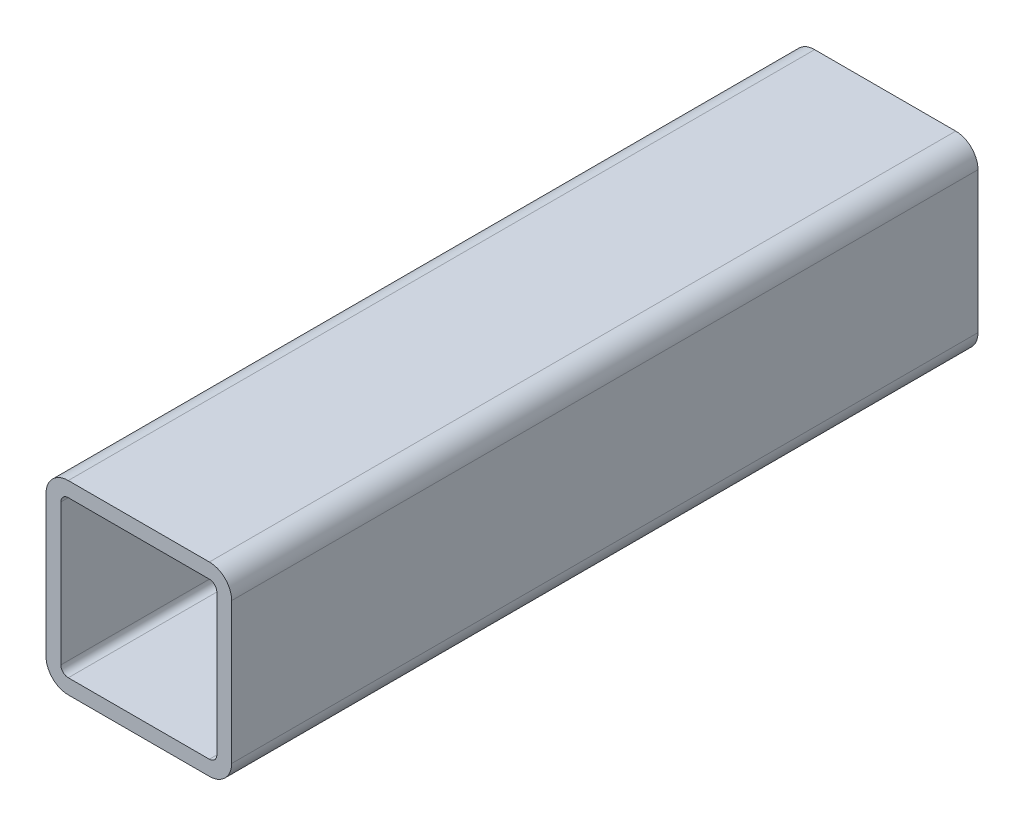
ISO-10303-21;
HEADER;
FILE_DESCRIPTION(('STEP AP214'),'2;1');
FILE_NAME('part.step','',(''),(''),'','','');
FILE_SCHEMA(('AUTOMOTIVE_DESIGN { 1 0 10303 214 1 1 1 1 }'));
ENDSEC;
DATA;
#1=APPLICATION_CONTEXT('core data for automotive mechanical design processes');
#2=APPLICATION_PROTOCOL_DEFINITION('international standard','automotive_design',2000,#1);
#3=PRODUCT_CONTEXT('',#1,'mechanical');
#4=PRODUCT('Part','Part','',(#3));
#5=PRODUCT_RELATED_PRODUCT_CATEGORY('part','',(#4));
#6=PRODUCT_DEFINITION_FORMATION('','',#4);
#7=PRODUCT_DEFINITION_CONTEXT('part definition',#1,'design');
#8=PRODUCT_DEFINITION('design','',#6,#7);
#9=PRODUCT_DEFINITION_SHAPE('','',#8);
#10=(LENGTH_UNIT() NAMED_UNIT(*) SI_UNIT(.MILLI.,.METRE.));
#11=(NAMED_UNIT(*) PLANE_ANGLE_UNIT() SI_UNIT($,.RADIAN.));
#12=(NAMED_UNIT(*) SI_UNIT($,.STERADIAN.) SOLID_ANGLE_UNIT());
#13=UNCERTAINTY_MEASURE_WITH_UNIT(LENGTH_MEASURE(1.E-05),#10,'distance_accuracy_value','');
#14=(GEOMETRIC_REPRESENTATION_CONTEXT(3) GLOBAL_UNCERTAINTY_ASSIGNED_CONTEXT((#13)) GLOBAL_UNIT_ASSIGNED_CONTEXT((#10,
#11,#12)) REPRESENTATION_CONTEXT('',''));
#15=CARTESIAN_POINT('',(0.,0.,0.));
#16=DIRECTION('',(0.,0.,1.));
#17=DIRECTION('',(1.,0.,0.));
#18=AXIS2_PLACEMENT_3D('',#15,#16,#17);
#19=CARTESIAN_POINT('',(5.6932236702778E-12,-7.38964445190504E-12,100.499999999996));
#20=DIRECTION('',(0.,0.,1.));
#21=DIRECTION('',(0.,-1.,0.));
#22=AXIS2_PLACEMENT_3D('',#19,#20,#21);
#23=PLANE('',#22);
#24=DIRECTION('',(0.,1.,0.));
#25=VECTOR('',#24,1.);
#26=CARTESIAN_POINT('',(-12.4999999999943,-4.7500000000074,100.499999999996));
#27=LINE('',#26,#25);
#28=CARTESIAN_POINT('',(-12.4999999999943,-9.50000000000742,100.499999999996));
#29=VERTEX_POINT('',#28);
#30=CARTESIAN_POINT('',(-12.4999999999943,9.49999999999257,100.499999999996));
#31=VERTEX_POINT('',#30);
#32=EDGE_CURVE('E242',#29,#31,#27,.T.);
#33=ORIENTED_EDGE('',*,*,#32,.F.);
#34=CARTESIAN_POINT('',(-9.4999999999943,-9.50000000000742,100.499999999996));
#35=DIRECTION('',(0.,0.,-1.));
#36=DIRECTION('',(1.,0.,0.));
#37=AXIS2_PLACEMENT_3D('',#34,#35,#36);
#38=CIRCLE('',#37,3.);
#39=CARTESIAN_POINT('',(-9.4999999999943,-12.5000000000074,100.499999999996));
#40=VERTEX_POINT('',#39);
#41=EDGE_CURVE('E355',#40,#29,#38,.T.);
#42=ORIENTED_EDGE('',*,*,#41,.F.);
#43=DIRECTION('',(-1.,0.,0.));
#44=VECTOR('',#43,1.);
#45=CARTESIAN_POINT('',(4.7500000000057,-12.5000000000075,100.499999999996));
#46=LINE('',#45,#44);
#47=CARTESIAN_POINT('',(9.50000000000569,-12.5000000000074,100.499999999996));
#48=VERTEX_POINT('',#47);
#49=EDGE_CURVE('E290',#48,#40,#46,.T.);
#50=ORIENTED_EDGE('',*,*,#49,.F.);
#51=CARTESIAN_POINT('',(9.50000000000569,-9.50000000000742,100.499999999996));
#52=DIRECTION('',(0.,0.,-1.));
#53=DIRECTION('',(0.,1.,0.));
#54=AXIS2_PLACEMENT_3D('',#51,#52,#53);
#55=CIRCLE('',#54,3.);
#56=CARTESIAN_POINT('',(12.5000000000057,-9.50000000000749,100.499999999996));
#57=VERTEX_POINT('',#56);
#58=EDGE_CURVE('E213',#57,#48,#55,.T.);
#59=ORIENTED_EDGE('',*,*,#58,.F.);
#60=DIRECTION('',(0.,-1.,0.));
#61=VECTOR('',#60,1.);
#62=CARTESIAN_POINT('',(12.5000000000057,4.74999999999248,100.499999999996));
#63=LINE('',#62,#61);
#64=CARTESIAN_POINT('',(12.5000000000057,9.4999999999925,100.499999999996));
#65=VERTEX_POINT('',#64);
#66=EDGE_CURVE('E224',#65,#57,#63,.T.);
#67=ORIENTED_EDGE('',*,*,#66,.F.);
#68=CARTESIAN_POINT('',(9.50000000000569,9.49999999999264,100.499999999996));
#69=DIRECTION('',(0.,0.,-1.));
#70=DIRECTION('',(-1.,0.,0.));
#71=AXIS2_PLACEMENT_3D('',#68,#69,#70);
#72=CIRCLE('',#71,3.);
#73=CARTESIAN_POINT('',(9.5000000000057,12.4999999999926,100.499999999996));
#74=VERTEX_POINT('',#73);
#75=EDGE_CURVE('E27',#74,#65,#72,.T.);
#76=ORIENTED_EDGE('',*,*,#75,.F.);
#77=DIRECTION('',(1.,0.,0.));
#78=VECTOR('',#77,1.);
#79=CARTESIAN_POINT('',(-4.74999999999431,12.4999999999926,100.499999999996));
#80=LINE('',#79,#78);
#81=CARTESIAN_POINT('',(-9.49999999999431,12.4999999999926,100.499999999996));
#82=VERTEX_POINT('',#81);
#83=EDGE_CURVE('E316',#82,#74,#80,.T.);
#84=ORIENTED_EDGE('',*,*,#83,.F.);
#85=CARTESIAN_POINT('',(-9.49999999999431,9.49999999999264,100.499999999996));
#86=DIRECTION('',(0.,0.,-1.));
#87=DIRECTION('',(0.,-1.,0.));
#88=AXIS2_PLACEMENT_3D('',#85,#86,#87);
#89=CIRCLE('',#88,3.);
#90=EDGE_CURVE('E269',#31,#82,#89,.T.);
#91=ORIENTED_EDGE('',*,*,#90,.F.);
#92=EDGE_LOOP('',(#33,#42,#50,#59,#67,#76,#84,#91));
#93=FACE_BOUND('',#92,.T.);
#94=DIRECTION('',(-1.,0.,0.));
#95=VECTOR('',#94,1.);
#96=CARTESIAN_POINT('',(-4.74999999999431,10.4999999999926,100.499999999996));
#97=LINE('',#96,#95);
#98=CARTESIAN_POINT('',(9.50000000000569,10.4999999999926,100.499999999996));
#99=VERTEX_POINT('',#98);
#100=CARTESIAN_POINT('',(-9.49999999999431,10.4999999999926,100.499999999996));
#101=VERTEX_POINT('',#100);
#102=EDGE_CURVE('E190',#99,#101,#97,.T.);
#103=ORIENTED_EDGE('',*,*,#102,.F.);
#104=CARTESIAN_POINT('',(9.50000000000569,9.49999999999264,100.499999999996));
#105=DIRECTION('',(0.,0.,1.));
#106=DIRECTION('',(-1.,0.,0.));
#107=AXIS2_PLACEMENT_3D('',#104,#105,#106);
#108=CIRCLE('',#107,1.);
#109=CARTESIAN_POINT('',(10.5000000000057,9.49999999999264,100.499999999996));
#110=VERTEX_POINT('',#109);
#111=EDGE_CURVE('E257',#110,#99,#108,.T.);
#112=ORIENTED_EDGE('',*,*,#111,.F.);
#113=DIRECTION('',(0.,1.,0.));
#114=VECTOR('',#113,1.);
#115=CARTESIAN_POINT('',(10.5000000000057,4.74999999999262,100.499999999996));
#116=LINE('',#115,#114);
#117=CARTESIAN_POINT('',(10.5000000000057,-9.50000000000735,100.499999999996));
#118=VERTEX_POINT('',#117);
#119=EDGE_CURVE('E270',#118,#110,#116,.T.);
#120=ORIENTED_EDGE('',*,*,#119,.F.);
#121=CARTESIAN_POINT('',(9.50000000000569,-9.50000000000742,100.499999999996));
#122=DIRECTION('',(0.,0.,1.));
#123=DIRECTION('',(0.,1.,0.));
#124=AXIS2_PLACEMENT_3D('',#121,#122,#123);
#125=CIRCLE('',#124,1.);
#126=CARTESIAN_POINT('',(9.50000000000569,-10.5000000000074,100.499999999996));
#127=VERTEX_POINT('',#126);
#128=EDGE_CURVE('E249',#127,#118,#125,.T.);
#129=ORIENTED_EDGE('',*,*,#128,.F.);
#130=DIRECTION('',(1.,0.,0.));
#131=VECTOR('',#130,1.);
#132=CARTESIAN_POINT('',(4.75000000000569,-10.5000000000074,100.499999999996));
#133=LINE('',#132,#131);
#134=CARTESIAN_POINT('',(-9.4999999999943,-10.5000000000074,100.499999999996));
#135=VERTEX_POINT('',#134);
#136=EDGE_CURVE('E281',#135,#127,#133,.T.);
#137=ORIENTED_EDGE('',*,*,#136,.F.);
#138=CARTESIAN_POINT('',(-9.4999999999943,-9.50000000000742,100.499999999996));
#139=DIRECTION('',(0.,0.,1.));
#140=DIRECTION('',(1.,0.,0.));
#141=AXIS2_PLACEMENT_3D('',#138,#139,#140);
#142=CIRCLE('',#141,1.);
#143=CARTESIAN_POINT('',(-10.4999999999943,-9.50000000000742,100.499999999996));
#144=VERTEX_POINT('',#143);
#145=EDGE_CURVE('E20',#144,#135,#142,.T.);
#146=ORIENTED_EDGE('',*,*,#145,.F.);
#147=DIRECTION('',(0.,-1.,0.));
#148=VECTOR('',#147,1.);
#149=CARTESIAN_POINT('',(-10.4999999999943,-4.7500000000074,100.499999999996));
#150=LINE('',#149,#148);
#151=CARTESIAN_POINT('',(-10.4999999999943,9.49999999999257,100.499999999996));
#152=VERTEX_POINT('',#151);
#153=EDGE_CURVE('E350',#152,#144,#150,.T.);
#154=ORIENTED_EDGE('',*,*,#153,.F.);
#155=CARTESIAN_POINT('',(-9.49999999999431,9.49999999999264,100.499999999996));
#156=DIRECTION('',(0.,0.,1.));
#157=DIRECTION('',(0.,-1.,0.));
#158=AXIS2_PLACEMENT_3D('',#155,#156,#157);
#159=CIRCLE('',#158,1.);
#160=EDGE_CURVE('E243',#101,#152,#159,.T.);
#161=ORIENTED_EDGE('',*,*,#160,.F.);
#162=EDGE_LOOP('',(#103,#112,#120,#129,#137,#146,#154,#161));
#163=FACE_BOUND('',#162,.T.);
#164=ADVANCED_FACE('F16',(#93,#163),#23,.T.);
#165=CARTESIAN_POINT('',(5.6932236702778E-12,-7.38964445190504E-12,-3.5527136788005E-12));
#166=DIRECTION('',(0.,0.,1.));
#167=DIRECTION('',(0.,-1.,0.));
#168=AXIS2_PLACEMENT_3D('',#165,#166,#167);
#169=PLANE('',#168);
#170=DIRECTION('',(0.,1.,0.));
#171=VECTOR('',#170,1.);
#172=CARTESIAN_POINT('',(-12.4999999999943,-4.7500000000074,-3.5527136788005E-12));
#173=LINE('',#172,#171);
#174=CARTESIAN_POINT('',(-12.4999999999943,-9.50000000000742,-3.5527136788005E-12));
#175=VERTEX_POINT('',#174);
#176=CARTESIAN_POINT('',(-12.4999999999943,9.49999999999257,-3.5527136788005E-12));
#177=VERTEX_POINT('',#176);
#178=EDGE_CURVE('E266',#175,#177,#173,.T.);
#179=ORIENTED_EDGE('',*,*,#178,.T.);
#180=CARTESIAN_POINT('',(-9.49999999999431,9.49999999999264,-3.5527136788005E-12));
#181=DIRECTION('',(0.,0.,-1.));
#182=DIRECTION('',(0.,-1.,0.));
#183=AXIS2_PLACEMENT_3D('',#180,#181,#182);
#184=CIRCLE('',#183,3.);
#185=CARTESIAN_POINT('',(-9.49999999999431,12.4999999999926,-3.5527136788005E-12));
#186=VERTEX_POINT('',#185);
#187=EDGE_CURVE('E320',#177,#186,#184,.T.);
#188=ORIENTED_EDGE('',*,*,#187,.T.);
#189=DIRECTION('',(1.,0.,0.));
#190=VECTOR('',#189,1.);
#191=CARTESIAN_POINT('',(-4.74999999999431,12.4999999999926,-3.5527136788005E-12));
#192=LINE('',#191,#190);
#193=CARTESIAN_POINT('',(9.50000000000569,12.4999999999926,-3.5527136788005E-12));
#194=VERTEX_POINT('',#193);
#195=EDGE_CURVE('E204',#186,#194,#192,.T.);
#196=ORIENTED_EDGE('',*,*,#195,.T.);
#197=CARTESIAN_POINT('',(9.50000000000569,9.49999999999264,-3.5527136788005E-12));
#198=DIRECTION('',(0.,0.,-1.));
#199=DIRECTION('',(-1.,0.,0.));
#200=AXIS2_PLACEMENT_3D('',#197,#198,#199);
#201=CIRCLE('',#200,3.);
#202=CARTESIAN_POINT('',(12.5000000000057,9.4999999999925,-3.5527136788005E-12));
#203=VERTEX_POINT('',#202);
#204=EDGE_CURVE('E11',#194,#203,#201,.T.);
#205=ORIENTED_EDGE('',*,*,#204,.T.);
#206=DIRECTION('',(0.,-1.,0.));
#207=VECTOR('',#206,1.);
#208=CARTESIAN_POINT('',(12.5000000000057,4.74999999999248,-3.5527136788005E-12));
#209=LINE('',#208,#207);
#210=CARTESIAN_POINT('',(12.5000000000057,-9.50000000000749,-3.5527136788005E-12));
#211=VERTEX_POINT('',#210);
#212=EDGE_CURVE('E201',#203,#211,#209,.T.);
#213=ORIENTED_EDGE('',*,*,#212,.T.);
#214=CARTESIAN_POINT('',(9.50000000000569,-9.50000000000742,-3.5527136788005E-12));
#215=DIRECTION('',(0.,0.,-1.));
#216=DIRECTION('',(0.,1.,0.));
#217=AXIS2_PLACEMENT_3D('',#214,#215,#216);
#218=CIRCLE('',#217,3.);
#219=CARTESIAN_POINT('',(9.50000000000569,-12.5000000000074,-3.5527136788005E-12));
#220=VERTEX_POINT('',#219);
#221=EDGE_CURVE('E288',#211,#220,#218,.T.);
#222=ORIENTED_EDGE('',*,*,#221,.T.);
#223=DIRECTION('',(-1.,0.,0.));
#224=VECTOR('',#223,1.);
#225=CARTESIAN_POINT('',(4.7500000000057,-12.5000000000075,-3.5527136788005E-12));
#226=LINE('',#225,#224);
#227=CARTESIAN_POINT('',(-9.4999999999943,-12.5000000000074,-3.5527136788005E-12));
#228=VERTEX_POINT('',#227);
#229=EDGE_CURVE('E360',#220,#228,#226,.T.);
#230=ORIENTED_EDGE('',*,*,#229,.T.);
#231=CARTESIAN_POINT('',(-9.4999999999943,-9.50000000000742,-3.5527136788005E-12));
#232=DIRECTION('',(0.,0.,-1.));
#233=DIRECTION('',(1.,0.,0.));
#234=AXIS2_PLACEMENT_3D('',#231,#232,#233);
#235=CIRCLE('',#234,3.);
#236=EDGE_CURVE('E313',#228,#175,#235,.T.);
#237=ORIENTED_EDGE('',*,*,#236,.T.);
#238=EDGE_LOOP('',(#179,#188,#196,#205,#213,#222,#230,#237));
#239=FACE_BOUND('',#238,.T.);
#240=DIRECTION('',(-1.,0.,0.));
#241=VECTOR('',#240,1.);
#242=CARTESIAN_POINT('',(-4.74999999999431,10.4999999999926,-3.5527136788005E-12));
#243=LINE('',#242,#241);
#244=CARTESIAN_POINT('',(9.50000000000569,10.4999999999926,-3.5527136788005E-12));
#245=VERTEX_POINT('',#244);
#246=CARTESIAN_POINT('',(-9.49999999999431,10.4999999999926,-3.5527136788005E-12));
#247=VERTEX_POINT('',#246);
#248=EDGE_CURVE('E179',#245,#247,#243,.T.);
#249=ORIENTED_EDGE('',*,*,#248,.T.);
#250=CARTESIAN_POINT('',(-9.49999999999431,9.49999999999264,-3.5527136788005E-12));
#251=DIRECTION('',(0.,0.,1.));
#252=DIRECTION('',(0.,-1.,0.));
#253=AXIS2_PLACEMENT_3D('',#250,#251,#252);
#254=CIRCLE('',#253,1.);
#255=CARTESIAN_POINT('',(-10.4999999999943,9.49999999999257,-3.5527136788005E-12));
#256=VERTEX_POINT('',#255);
#257=EDGE_CURVE('E238',#247,#256,#254,.T.);
#258=ORIENTED_EDGE('',*,*,#257,.T.);
#259=DIRECTION('',(0.,-1.,0.));
#260=VECTOR('',#259,1.);
#261=CARTESIAN_POINT('',(-10.4999999999943,-4.7500000000074,-3.5527136788005E-12));
#262=LINE('',#261,#260);
#263=CARTESIAN_POINT('',(-10.4999999999943,-9.50000000000742,-3.5527136788005E-12));
#264=VERTEX_POINT('',#263);
#265=EDGE_CURVE('E310',#256,#264,#262,.T.);
#266=ORIENTED_EDGE('',*,*,#265,.T.);
#267=CARTESIAN_POINT('',(-9.4999999999943,-9.50000000000742,-3.5527136788005E-12));
#268=DIRECTION('',(0.,0.,1.));
#269=DIRECTION('',(1.,0.,0.));
#270=AXIS2_PLACEMENT_3D('',#267,#268,#269);
#271=CIRCLE('',#270,1.);
#272=CARTESIAN_POINT('',(-9.4999999999943,-10.5000000000074,-3.5527136788005E-12));
#273=VERTEX_POINT('',#272);
#274=EDGE_CURVE('E351',#264,#273,#271,.T.);
#275=ORIENTED_EDGE('',*,*,#274,.T.);
#276=DIRECTION('',(1.,0.,0.));
#277=VECTOR('',#276,1.);
#278=CARTESIAN_POINT('',(4.75000000000569,-10.5000000000074,-3.5527136788005E-12));
#279=LINE('',#278,#277);
#280=CARTESIAN_POINT('',(9.50000000000569,-10.5000000000074,-3.5527136788005E-12));
#281=VERTEX_POINT('',#280);
#282=EDGE_CURVE('E232',#273,#281,#279,.T.);
#283=ORIENTED_EDGE('',*,*,#282,.T.);
#284=CARTESIAN_POINT('',(9.50000000000569,-9.50000000000742,-3.5527136788005E-12));
#285=DIRECTION('',(0.,0.,1.));
#286=DIRECTION('',(0.,1.,0.));
#287=AXIS2_PLACEMENT_3D('',#284,#285,#286);
#288=CIRCLE('',#287,1.);
#289=CARTESIAN_POINT('',(10.5000000000057,-9.50000000000735,-3.5527136788005E-12));
#290=VERTEX_POINT('',#289);
#291=EDGE_CURVE('E248',#281,#290,#288,.T.);
#292=ORIENTED_EDGE('',*,*,#291,.T.);
#293=DIRECTION('',(0.,1.,0.));
#294=VECTOR('',#293,1.);
#295=CARTESIAN_POINT('',(10.5000000000057,4.74999999999262,-3.5527136788005E-12));
#296=LINE('',#295,#294);
#297=CARTESIAN_POINT('',(10.5000000000057,9.49999999999264,-3.5527136788005E-12));
#298=VERTEX_POINT('',#297);
#299=EDGE_CURVE('E261',#290,#298,#296,.T.);
#300=ORIENTED_EDGE('',*,*,#299,.T.);
#301=CARTESIAN_POINT('',(9.50000000000569,9.49999999999264,-3.5527136788005E-12));
#302=DIRECTION('',(0.,0.,1.));
#303=DIRECTION('',(-1.,0.,0.));
#304=AXIS2_PLACEMENT_3D('',#301,#302,#303);
#305=CIRCLE('',#304,1.);
#306=EDGE_CURVE('E352',#298,#245,#305,.T.);
#307=ORIENTED_EDGE('',*,*,#306,.T.);
#308=EDGE_LOOP('',(#249,#258,#266,#275,#283,#292,#300,#307));
#309=FACE_BOUND('',#308,.T.);
#310=ADVANCED_FACE('F197',(#239,#309),#169,.F.);
#311=CARTESIAN_POINT('',(9.50000000000569,9.49999999999264,-3.5527136788005E-12));
#312=DIRECTION('',(0.,0.,1.));
#313=DIRECTION('',(-1.,0.,0.));
#314=AXIS2_PLACEMENT_3D('',#311,#312,#313);
#315=CYLINDRICAL_SURFACE('',#314,3.);
#316=ORIENTED_EDGE('',*,*,#75,.T.);
#317=DIRECTION('',(0.,0.,1.));
#318=VECTOR('',#317,1.);
#319=CARTESIAN_POINT('',(12.5000000000057,9.4999999999925,-3.5527136788005E-12));
#320=LINE('',#319,#318);
#321=EDGE_CURVE('E207',#203,#65,#320,.T.);
#322=ORIENTED_EDGE('',*,*,#321,.F.);
#323=ORIENTED_EDGE('',*,*,#204,.F.);
#324=DIRECTION('',(0.,0.,1.));
#325=VECTOR('',#324,1.);
#326=CARTESIAN_POINT('',(9.50000000000569,12.4999999999926,-3.5527136788005E-12));
#327=LINE('',#326,#325);
#328=EDGE_CURVE('E252',#194,#74,#327,.T.);
#329=ORIENTED_EDGE('',*,*,#328,.T.);
#330=EDGE_LOOP('',(#316,#322,#323,#329));
#331=FACE_BOUND('',#330,.T.);
#332=ADVANCED_FACE('F208',(#331),#315,.T.);
#333=CARTESIAN_POINT('',(-9.49999999999431,12.4999999999926,-3.5527136788005E-12));
#334=DIRECTION('',(0.,1.,0.));
#335=DIRECTION('',(1.,0.,0.));
#336=AXIS2_PLACEMENT_3D('',#333,#334,#335);
#337=PLANE('',#336);
#338=ORIENTED_EDGE('',*,*,#83,.T.);
#339=ORIENTED_EDGE('',*,*,#328,.F.);
#340=ORIENTED_EDGE('',*,*,#195,.F.);
#341=DIRECTION('',(0.,0.,1.));
#342=VECTOR('',#341,1.);
#343=CARTESIAN_POINT('',(-9.49999999999431,12.4999999999926,-3.5527136788005E-12));
#344=LINE('',#343,#342);
#345=EDGE_CURVE('E321',#186,#82,#344,.T.);
#346=ORIENTED_EDGE('',*,*,#345,.T.);
#347=EDGE_LOOP('',(#338,#339,#340,#346));
#348=FACE_BOUND('',#347,.T.);
#349=ADVANCED_FACE('F399',(#348),#337,.T.);
#350=CARTESIAN_POINT('',(-9.49999999999431,9.49999999999264,-3.5527136788005E-12));
#351=DIRECTION('',(0.,0.,1.));
#352=DIRECTION('',(0.,-1.,0.));
#353=AXIS2_PLACEMENT_3D('',#350,#351,#352);
#354=CYLINDRICAL_SURFACE('',#353,3.);
#355=ORIENTED_EDGE('',*,*,#90,.T.);
#356=ORIENTED_EDGE('',*,*,#345,.F.);
#357=ORIENTED_EDGE('',*,*,#187,.F.);
#358=DIRECTION('',(0.,0.,1.));
#359=VECTOR('',#358,1.);
#360=CARTESIAN_POINT('',(-12.4999999999943,9.49999999999257,-3.5527136788005E-12));
#361=LINE('',#360,#359);
#362=EDGE_CURVE('E265',#177,#31,#361,.T.);
#363=ORIENTED_EDGE('',*,*,#362,.T.);
#364=EDGE_LOOP('',(#355,#356,#357,#363));
#365=FACE_BOUND('',#364,.T.);
#366=ADVANCED_FACE('F397',(#365),#354,.T.);
#367=CARTESIAN_POINT('',(-12.4999999999943,-9.50000000000742,-3.5527136788005E-12));
#368=DIRECTION('',(-1.,0.,0.));
#369=DIRECTION('',(0.,1.,0.));
#370=AXIS2_PLACEMENT_3D('',#367,#368,#369);
#371=PLANE('',#370);
#372=ORIENTED_EDGE('',*,*,#32,.T.);
#373=ORIENTED_EDGE('',*,*,#362,.F.);
#374=ORIENTED_EDGE('',*,*,#178,.F.);
#375=DIRECTION('',(0.,0.,1.));
#376=VECTOR('',#375,1.);
#377=CARTESIAN_POINT('',(-12.4999999999943,-9.50000000000742,-3.5527136788005E-12));
#378=LINE('',#377,#376);
#379=EDGE_CURVE('E359',#175,#29,#378,.T.);
#380=ORIENTED_EDGE('',*,*,#379,.T.);
#381=EDGE_LOOP('',(#372,#373,#374,#380));
#382=FACE_BOUND('',#381,.T.);
#383=CARTESIAN_POINT('',(-12.4999999999943,2.49999999999353,35.4999999999958));
#384=DIRECTION('',(1.,0.,0.));
#385=DIRECTION('',(0.,-1.,0.));
#386=AXIS2_PLACEMENT_3D('',#383,#384,#385);
#387=CIRCLE('',#386,3.8235);
#388=CARTESIAN_POINT('',(-12.4999999999943,-1.32350000000649,35.4999999999958));
#389=VERTEX_POINT('',#388);
#390=EDGE_CURVE('E100',#389,#389,#387,.T.);
#391=ORIENTED_EDGE('',*,*,#390,.T.);
#392=EDGE_LOOP('',(#391));
#393=FACE_BOUND('',#392,.T.);
#394=CARTESIAN_POINT('',(-12.4999999999943,2.4999999999973,83.4999999999975));
#395=DIRECTION('',(1.,0.,0.));
#396=DIRECTION('',(0.,-1.,0.));
#397=AXIS2_PLACEMENT_3D('',#394,#395,#396);
#398=CIRCLE('',#397,3.8235);
#399=CARTESIAN_POINT('',(-12.4999999999943,-1.32350000000272,83.4999999999975));
#400=VERTEX_POINT('',#399);
#401=EDGE_CURVE('E253',#400,#400,#398,.T.);
#402=ORIENTED_EDGE('',*,*,#401,.T.);
#403=EDGE_LOOP('',(#402));
#404=FACE_BOUND('',#403,.T.);
#405=ADVANCED_FACE('F423',(#382,#393,#404),#371,.T.);
#406=CARTESIAN_POINT('',(-9.49999999999431,9.49999999999264,-3.5527136788005E-12));
#407=DIRECTION('',(0.,0.,1.));
#408=DIRECTION('',(0.,-1.,0.));
#409=AXIS2_PLACEMENT_3D('',#406,#407,#408);
#410=CYLINDRICAL_SURFACE('',#409,1.);
#411=ORIENTED_EDGE('',*,*,#160,.T.);
#412=DIRECTION('',(0.,0.,1.));
#413=VECTOR('',#412,1.);
#414=CARTESIAN_POINT('',(-10.4999999999943,9.49999999999257,-3.5527136788005E-12));
#415=LINE('',#414,#413);
#416=EDGE_CURVE('E284',#256,#152,#415,.T.);
#417=ORIENTED_EDGE('',*,*,#416,.F.);
#418=ORIENTED_EDGE('',*,*,#257,.F.);
#419=DIRECTION('',(0.,0.,1.));
#420=VECTOR('',#419,1.);
#421=CARTESIAN_POINT('',(-9.49999999999431,10.4999999999926,-3.5527136788005E-12));
#422=LINE('',#421,#420);
#423=EDGE_CURVE('E277',#247,#101,#422,.T.);
#424=ORIENTED_EDGE('',*,*,#423,.T.);
#425=EDGE_LOOP('',(#411,#417,#418,#424));
#426=FACE_BOUND('',#425,.T.);
#427=ADVANCED_FACE('F435',(#426),#410,.F.);
#428=CARTESIAN_POINT('',(-10.4999999999943,-9.50000000000742,-3.5527136788005E-12));
#429=DIRECTION('',(-1.,0.,0.));
#430=DIRECTION('',(0.,0.,1.));
#431=AXIS2_PLACEMENT_3D('',#428,#429,#430);
#432=PLANE('',#431);
#433=ORIENTED_EDGE('',*,*,#153,.T.);
#434=DIRECTION('',(0.,0.,1.));
#435=VECTOR('',#434,1.);
#436=CARTESIAN_POINT('',(-10.4999999999943,-9.50000000000742,-3.5527136788005E-12));
#437=LINE('',#436,#435);
#438=EDGE_CURVE('E347',#264,#144,#437,.T.);
#439=ORIENTED_EDGE('',*,*,#438,.F.);
#440=ORIENTED_EDGE('',*,*,#265,.F.);
#441=ORIENTED_EDGE('',*,*,#416,.T.);
#442=EDGE_LOOP('',(#433,#439,#440,#441));
#443=FACE_BOUND('',#442,.T.);
#444=CARTESIAN_POINT('',(-10.4999999999943,2.49999999999353,35.4999999999958));
#445=DIRECTION('',(-1.,0.,0.));
#446=DIRECTION('',(0.,-1.,0.));
#447=AXIS2_PLACEMENT_3D('',#444,#445,#446);
#448=CIRCLE('',#447,3.8235);
#449=CARTESIAN_POINT('',(-10.4999999999943,6.32349999999356,35.4999999999958));
#450=VERTEX_POINT('',#449);
#451=EDGE_CURVE('E94',#450,#450,#448,.T.);
#452=ORIENTED_EDGE('',*,*,#451,.T.);
#453=EDGE_LOOP('',(#452));
#454=FACE_BOUND('',#453,.T.);
#455=CARTESIAN_POINT('',(-10.4999999999943,2.4999999999973,83.4999999999975));
#456=DIRECTION('',(-1.,0.,0.));
#457=DIRECTION('',(0.,-1.,0.));
#458=AXIS2_PLACEMENT_3D('',#455,#456,#457);
#459=CIRCLE('',#458,3.8235);
#460=CARTESIAN_POINT('',(-10.4999999999943,6.32349999999732,83.4999999999975));
#461=VERTEX_POINT('',#460);
#462=EDGE_CURVE('E256',#461,#461,#459,.T.);
#463=ORIENTED_EDGE('',*,*,#462,.T.);
#464=EDGE_LOOP('',(#463));
#465=FACE_BOUND('',#464,.T.);
#466=ADVANCED_FACE('F432',(#443,#454,#465),#432,.F.);
#467=CARTESIAN_POINT('',(-9.4999999999943,-9.50000000000742,-3.5527136788005E-12));
#468=DIRECTION('',(0.,0.,1.));
#469=DIRECTION('',(1.,0.,0.));
#470=AXIS2_PLACEMENT_3D('',#467,#468,#469);
#471=CYLINDRICAL_SURFACE('',#470,1.);
#472=ORIENTED_EDGE('',*,*,#145,.T.);
#473=DIRECTION('',(0.,0.,1.));
#474=VECTOR('',#473,1.);
#475=CARTESIAN_POINT('',(-9.4999999999943,-10.5000000000074,-3.5527136788005E-12));
#476=LINE('',#475,#474);
#477=EDGE_CURVE('E236',#273,#135,#476,.T.);
#478=ORIENTED_EDGE('',*,*,#477,.F.);
#479=ORIENTED_EDGE('',*,*,#274,.F.);
#480=ORIENTED_EDGE('',*,*,#438,.T.);
#481=EDGE_LOOP('',(#472,#478,#479,#480));
#482=FACE_BOUND('',#481,.T.);
#483=ADVANCED_FACE('F434',(#482),#471,.F.);
#484=CARTESIAN_POINT('',(-9.49999999999431,10.4999999999926,-3.5527136788005E-12));
#485=DIRECTION('',(0.,1.,0.));
#486=DIRECTION('',(1.,0.,0.));
#487=AXIS2_PLACEMENT_3D('',#484,#485,#486);
#488=PLANE('',#487);
#489=ORIENTED_EDGE('',*,*,#102,.T.);
#490=ORIENTED_EDGE('',*,*,#423,.F.);
#491=ORIENTED_EDGE('',*,*,#248,.F.);
#492=DIRECTION('',(0.,0.,1.));
#493=VECTOR('',#492,1.);
#494=CARTESIAN_POINT('',(9.50000000000569,10.4999999999926,-3.5527136788005E-12));
#495=LINE('',#494,#493);
#496=EDGE_CURVE('E228',#245,#99,#495,.T.);
#497=ORIENTED_EDGE('',*,*,#496,.T.);
#498=EDGE_LOOP('',(#489,#490,#491,#497));
#499=FACE_BOUND('',#498,.T.);
#500=ADVANCED_FACE('F440',(#499),#488,.F.);
#501=CARTESIAN_POINT('',(-9.4999999999943,-9.50000000000742,-3.5527136788005E-12));
#502=DIRECTION('',(0.,0.,1.));
#503=DIRECTION('',(1.,0.,0.));
#504=AXIS2_PLACEMENT_3D('',#501,#502,#503);
#505=CYLINDRICAL_SURFACE('',#504,3.);
#506=ORIENTED_EDGE('',*,*,#41,.T.);
#507=ORIENTED_EDGE('',*,*,#379,.F.);
#508=ORIENTED_EDGE('',*,*,#236,.F.);
#509=DIRECTION('',(0.,0.,1.));
#510=VECTOR('',#509,1.);
#511=CARTESIAN_POINT('',(-9.4999999999943,-12.5000000000074,-3.5527136788005E-12));
#512=LINE('',#511,#510);
#513=EDGE_CURVE('E298',#228,#40,#512,.T.);
#514=ORIENTED_EDGE('',*,*,#513,.T.);
#515=EDGE_LOOP('',(#506,#507,#508,#514));
#516=FACE_BOUND('',#515,.T.);
#517=ADVANCED_FACE('F18',(#516),#505,.T.);
#518=CARTESIAN_POINT('',(9.50000000000569,-12.5000000000074,-3.5527136788005E-12));
#519=DIRECTION('',(0.,-1.,0.));
#520=DIRECTION('',(0.,0.,-1.));
#521=AXIS2_PLACEMENT_3D('',#518,#519,#520);
#522=PLANE('',#521);
#523=ORIENTED_EDGE('',*,*,#49,.T.);
#524=ORIENTED_EDGE('',*,*,#513,.F.);
#525=ORIENTED_EDGE('',*,*,#229,.F.);
#526=DIRECTION('',(0.,0.,1.));
#527=VECTOR('',#526,1.);
#528=CARTESIAN_POINT('',(9.50000000000569,-12.5000000000074,-3.5527136788005E-12));
#529=LINE('',#528,#527);
#530=EDGE_CURVE('E287',#220,#48,#529,.T.);
#531=ORIENTED_EDGE('',*,*,#530,.T.);
#532=EDGE_LOOP('',(#523,#524,#525,#531));
#533=FACE_BOUND('',#532,.T.);
#534=ADVANCED_FACE('F404',(#533),#522,.T.);
#535=CARTESIAN_POINT('',(9.50000000000569,-9.50000000000742,-3.5527136788005E-12));
#536=DIRECTION('',(0.,0.,1.));
#537=DIRECTION('',(0.,1.,0.));
#538=AXIS2_PLACEMENT_3D('',#535,#536,#537);
#539=CYLINDRICAL_SURFACE('',#538,3.);
#540=ORIENTED_EDGE('',*,*,#58,.T.);
#541=ORIENTED_EDGE('',*,*,#530,.F.);
#542=ORIENTED_EDGE('',*,*,#221,.F.);
#543=DIRECTION('',(0.,0.,1.));
#544=VECTOR('',#543,1.);
#545=CARTESIAN_POINT('',(12.5000000000057,-9.50000000000749,-3.5527136788005E-12));
#546=LINE('',#545,#544);
#547=EDGE_CURVE('E217',#211,#57,#546,.T.);
#548=ORIENTED_EDGE('',*,*,#547,.T.);
#549=EDGE_LOOP('',(#540,#541,#542,#548));
#550=FACE_BOUND('',#549,.T.);
#551=ADVANCED_FACE('F402',(#550),#539,.T.);
#552=CARTESIAN_POINT('',(12.5000000000057,9.4999999999925,-3.5527136788005E-12));
#553=DIRECTION('',(1.,0.,0.));
#554=DIRECTION('',(0.,1.,0.));
#555=AXIS2_PLACEMENT_3D('',#552,#553,#554);
#556=PLANE('',#555);
#557=ORIENTED_EDGE('',*,*,#66,.T.);
#558=ORIENTED_EDGE('',*,*,#547,.F.);
#559=ORIENTED_EDGE('',*,*,#212,.F.);
#560=ORIENTED_EDGE('',*,*,#321,.T.);
#561=EDGE_LOOP('',(#557,#558,#559,#560));
#562=FACE_BOUND('',#561,.T.);
#563=ADVANCED_FACE('F215',(#562),#556,.T.);
#564=CARTESIAN_POINT('',(9.50000000000569,9.49999999999264,-3.5527136788005E-12));
#565=DIRECTION('',(0.,0.,1.));
#566=DIRECTION('',(-1.,0.,0.));
#567=AXIS2_PLACEMENT_3D('',#564,#565,#566);
#568=CYLINDRICAL_SURFACE('',#567,1.);
#569=ORIENTED_EDGE('',*,*,#111,.T.);
#570=ORIENTED_EDGE('',*,*,#496,.F.);
#571=ORIENTED_EDGE('',*,*,#306,.F.);
#572=DIRECTION('',(0.,0.,1.));
#573=VECTOR('',#572,1.);
#574=CARTESIAN_POINT('',(10.5000000000057,9.49999999999264,-3.5527136788005E-12));
#575=LINE('',#574,#573);
#576=EDGE_CURVE('E273',#298,#110,#575,.T.);
#577=ORIENTED_EDGE('',*,*,#576,.T.);
#578=EDGE_LOOP('',(#569,#570,#571,#577));
#579=FACE_BOUND('',#578,.T.);
#580=ADVANCED_FACE('F411',(#579),#568,.F.);
#581=CARTESIAN_POINT('',(10.5000000000057,9.49999999999264,-3.5527136788005E-12));
#582=DIRECTION('',(1.,0.,0.));
#583=DIRECTION('',(0.,-1.,0.));
#584=AXIS2_PLACEMENT_3D('',#581,#582,#583);
#585=PLANE('',#584);
#586=ORIENTED_EDGE('',*,*,#119,.T.);
#587=ORIENTED_EDGE('',*,*,#576,.F.);
#588=ORIENTED_EDGE('',*,*,#299,.F.);
#589=DIRECTION('',(0.,0.,1.));
#590=VECTOR('',#589,1.);
#591=CARTESIAN_POINT('',(10.5000000000057,-9.50000000000735,-3.5527136788005E-12));
#592=LINE('',#591,#590);
#593=EDGE_CURVE('E244',#290,#118,#592,.T.);
#594=ORIENTED_EDGE('',*,*,#593,.T.);
#595=EDGE_LOOP('',(#586,#587,#588,#594));
#596=FACE_BOUND('',#595,.T.);
#597=ADVANCED_FACE('F627',(#596),#585,.F.);
#598=CARTESIAN_POINT('',(9.50000000000569,-9.50000000000742,-3.5527136788005E-12));
#599=DIRECTION('',(0.,0.,1.));
#600=DIRECTION('',(0.,1.,0.));
#601=AXIS2_PLACEMENT_3D('',#598,#599,#600);
#602=CYLINDRICAL_SURFACE('',#601,1.);
#603=ORIENTED_EDGE('',*,*,#128,.T.);
#604=ORIENTED_EDGE('',*,*,#593,.F.);
#605=ORIENTED_EDGE('',*,*,#291,.F.);
#606=DIRECTION('',(0.,0.,1.));
#607=VECTOR('',#606,1.);
#608=CARTESIAN_POINT('',(9.50000000000569,-10.5000000000074,-3.5527136788005E-12));
#609=LINE('',#608,#607);
#610=EDGE_CURVE('E237',#281,#127,#609,.T.);
#611=ORIENTED_EDGE('',*,*,#610,.T.);
#612=EDGE_LOOP('',(#603,#604,#605,#611));
#613=FACE_BOUND('',#612,.T.);
#614=ADVANCED_FACE('F623',(#613),#602,.F.);
#615=CARTESIAN_POINT('',(9.50000000000569,-10.5000000000074,-3.5527136788005E-12));
#616=DIRECTION('',(0.,-1.,0.));
#617=DIRECTION('',(0.,0.,-1.));
#618=AXIS2_PLACEMENT_3D('',#615,#616,#617);
#619=PLANE('',#618);
#620=ORIENTED_EDGE('',*,*,#136,.T.);
#621=ORIENTED_EDGE('',*,*,#610,.F.);
#622=ORIENTED_EDGE('',*,*,#282,.F.);
#623=ORIENTED_EDGE('',*,*,#477,.T.);
#624=EDGE_LOOP('',(#620,#621,#622,#623));
#625=FACE_BOUND('',#624,.T.);
#626=ADVANCED_FACE('F429',(#625),#619,.F.);
#627=CARTESIAN_POINT('',(-8.49999999999431,2.49999999999353,35.4999999999958));
#628=DIRECTION('',(-1.,0.,0.));
#629=DIRECTION('',(0.,-1.,0.));
#630=AXIS2_PLACEMENT_3D('',#627,#628,#629);
#631=CYLINDRICAL_SURFACE('',#630,3.8235);
#632=ORIENTED_EDGE('',*,*,#390,.F.);
#633=EDGE_LOOP('',(#632));
#634=FACE_BOUND('',#633,.T.);
#635=ORIENTED_EDGE('',*,*,#451,.F.);
#636=EDGE_LOOP('',(#635));
#637=FACE_BOUND('',#636,.T.);
#638=ADVANCED_FACE('F425',(#634,#637),#631,.F.);
#639=CARTESIAN_POINT('',(-8.49999999999431,2.4999999999973,83.4999999999975));
#640=DIRECTION('',(-1.,0.,0.));
#641=DIRECTION('',(0.,-1.,0.));
#642=AXIS2_PLACEMENT_3D('',#639,#640,#641);
#643=CYLINDRICAL_SURFACE('',#642,3.8235);
#644=ORIENTED_EDGE('',*,*,#401,.F.);
#645=EDGE_LOOP('',(#644));
#646=FACE_BOUND('',#645,.T.);
#647=ORIENTED_EDGE('',*,*,#462,.F.);
#648=EDGE_LOOP('',(#647));
#649=FACE_BOUND('',#648,.T.);
#650=ADVANCED_FACE('F428',(#646,#649),#643,.F.);
#651=CLOSED_SHELL('',(#164,#310,#332,#349,#366,#405,#427,#466,#483,#500,#517,#534,#551,#563,
#580,#597,#614,#626,#638,#650));
#652=MANIFOLD_SOLID_BREP('B1',#651);
#653=ADVANCED_BREP_SHAPE_REPRESENTATION('',(#18,#652),#14);
#654=SHAPE_DEFINITION_REPRESENTATION(#9,#653);
ENDSEC;
END-ISO-10303-21;
